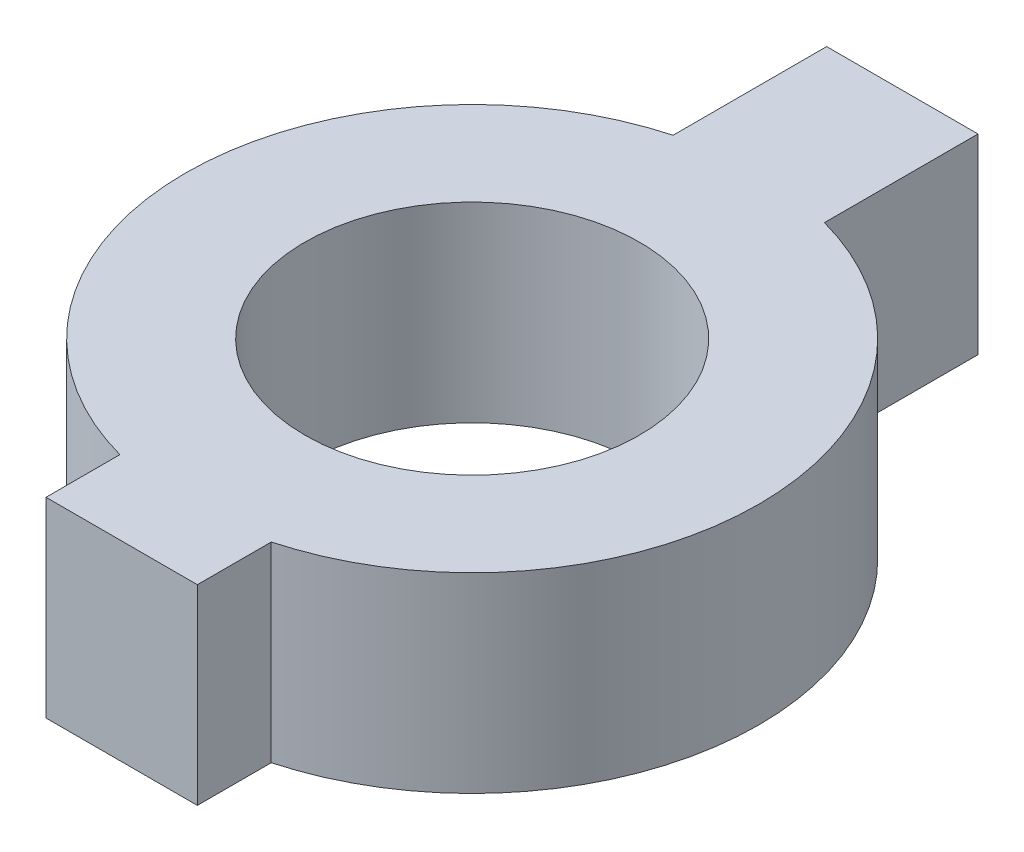
ISO-10303-21;
HEADER;
FILE_DESCRIPTION(('STEP AP214'),'2;1');
FILE_NAME('part.step','',(''),(''),'','','');
FILE_SCHEMA(('AUTOMOTIVE_DESIGN { 1 0 10303 214 1 1 1 1 }'));
ENDSEC;
DATA;
#1=APPLICATION_CONTEXT('core data for automotive mechanical design processes');
#2=APPLICATION_PROTOCOL_DEFINITION('international standard','automotive_design',2000,#1);
#3=PRODUCT_CONTEXT('',#1,'mechanical');
#4=PRODUCT('Part','Part','',(#3));
#5=PRODUCT_RELATED_PRODUCT_CATEGORY('part','',(#4));
#6=PRODUCT_DEFINITION_FORMATION('','',#4);
#7=PRODUCT_DEFINITION_CONTEXT('part definition',#1,'design');
#8=PRODUCT_DEFINITION('design','',#6,#7);
#9=PRODUCT_DEFINITION_SHAPE('','',#8);
#10=(LENGTH_UNIT() NAMED_UNIT(*) SI_UNIT(.MILLI.,.METRE.));
#11=(NAMED_UNIT(*) PLANE_ANGLE_UNIT() SI_UNIT($,.RADIAN.));
#12=(NAMED_UNIT(*) SI_UNIT($,.STERADIAN.) SOLID_ANGLE_UNIT());
#13=UNCERTAINTY_MEASURE_WITH_UNIT(LENGTH_MEASURE(1.E-05),#10,'distance_accuracy_value','');
#14=(GEOMETRIC_REPRESENTATION_CONTEXT(3) GLOBAL_UNCERTAINTY_ASSIGNED_CONTEXT((#13)) GLOBAL_UNIT_ASSIGNED_CONTEXT((#10,
#11,#12)) REPRESENTATION_CONTEXT('',''));
#15=CARTESIAN_POINT('',(0.,0.,0.));
#16=DIRECTION('',(0.,0.,1.));
#17=DIRECTION('',(1.,0.,0.));
#18=AXIS2_PLACEMENT_3D('',#15,#16,#17);
#19=CARTESIAN_POINT('',(0.,12.,0.));
#20=DIRECTION('',(0.,-1.,0.));
#21=DIRECTION('',(0.,0.,-1.));
#22=AXIS2_PLACEMENT_3D('',#19,#20,#21);
#23=CYLINDRICAL_SURFACE('',#22,18.);
#24=CARTESIAN_POINT('',(0.,0.,0.));
#25=DIRECTION('',(0.,1.,0.));
#26=DIRECTION('',(0.,0.,1.));
#27=AXIS2_PLACEMENT_3D('',#24,#25,#26);
#28=CIRCLE('',#27,18.);
#29=CARTESIAN_POINT('',(4.75,0.,17.3619555350197));
#30=VERTEX_POINT('',#29);
#31=CARTESIAN_POINT('',(4.74999999999999,0.,-17.3619555350197));
#32=VERTEX_POINT('',#31);
#33=EDGE_CURVE('E148',#30,#32,#28,.T.);
#34=ORIENTED_EDGE('',*,*,#33,.T.);
#35=DIRECTION('',(0.,-1.,0.));
#36=VECTOR('',#35,1.);
#37=CARTESIAN_POINT('',(4.74999999999999,12.,-17.3619555350197));
#38=LINE('',#37,#36);
#39=CARTESIAN_POINT('',(4.74999999999999,12.,-17.3619555350197));
#40=VERTEX_POINT('',#39);
#41=EDGE_CURVE('E11',#40,#32,#38,.T.);
#42=ORIENTED_EDGE('',*,*,#41,.F.);
#43=CARTESIAN_POINT('',(0.,12.,0.));
#44=DIRECTION('',(0.,1.,0.));
#45=DIRECTION('',(0.,0.,1.));
#46=AXIS2_PLACEMENT_3D('',#43,#44,#45);
#47=CIRCLE('',#46,18.);
#48=CARTESIAN_POINT('',(4.75,12.,17.3619555350197));
#49=VERTEX_POINT('',#48);
#50=EDGE_CURVE('E137',#49,#40,#47,.T.);
#51=ORIENTED_EDGE('',*,*,#50,.F.);
#52=DIRECTION('',(0.,-1.,0.));
#53=VECTOR('',#52,1.);
#54=CARTESIAN_POINT('',(4.75,12.,17.3619555350197));
#55=LINE('',#54,#53);
#56=EDGE_CURVE('E143',#49,#30,#55,.T.);
#57=ORIENTED_EDGE('',*,*,#56,.T.);
#58=EDGE_LOOP('',(#34,#42,#51,#57));
#59=FACE_BOUND('',#58,.T.);
#60=ADVANCED_FACE('F37',(#59),#23,.T.);
#61=CARTESIAN_POINT('',(4.74999999999999,12.,0.));
#62=DIRECTION('',(-1.,0.,0.));
#63=DIRECTION('',(0.,0.,1.));
#64=AXIS2_PLACEMENT_3D('',#61,#62,#63);
#65=PLANE('',#64);
#66=DIRECTION('',(0.,0.,-1.));
#67=VECTOR('',#66,1.);
#68=CARTESIAN_POINT('',(4.74999999999999,0.,0.));
#69=LINE('',#68,#67);
#70=CARTESIAN_POINT('',(4.74999999999998,0.,-27.));
#71=VERTEX_POINT('',#70);
#72=EDGE_CURVE('E152',#32,#71,#69,.T.);
#73=ORIENTED_EDGE('',*,*,#72,.T.);
#74=DIRECTION('',(0.,-1.,0.));
#75=VECTOR('',#74,1.);
#76=CARTESIAN_POINT('',(4.74999999999998,12.,-27.));
#77=LINE('',#76,#75);
#78=CARTESIAN_POINT('',(4.74999999999998,12.,-27.));
#79=VERTEX_POINT('',#78);
#80=EDGE_CURVE('E47',#79,#71,#77,.T.);
#81=ORIENTED_EDGE('',*,*,#80,.F.);
#82=DIRECTION('',(0.,0.,-1.));
#83=VECTOR('',#82,1.);
#84=CARTESIAN_POINT('',(4.74999999999999,12.,0.));
#85=LINE('',#84,#83);
#86=EDGE_CURVE('E97',#40,#79,#85,.T.);
#87=ORIENTED_EDGE('',*,*,#86,.F.);
#88=ORIENTED_EDGE('',*,*,#41,.T.);
#89=EDGE_LOOP('',(#73,#81,#87,#88));
#90=FACE_BOUND('',#89,.T.);
#91=ADVANCED_FACE('F190',(#90),#65,.F.);
#92=CARTESIAN_POINT('',(0.,12.,-27.));
#93=DIRECTION('',(0.,0.,-1.));
#94=DIRECTION('',(-1.,0.,0.));
#95=AXIS2_PLACEMENT_3D('',#92,#93,#94);
#96=PLANE('',#95);
#97=DIRECTION('',(1.,0.,0.));
#98=VECTOR('',#97,1.);
#99=CARTESIAN_POINT('',(0.,0.,-27.));
#100=LINE('',#99,#98);
#101=CARTESIAN_POINT('',(-4.75,0.,-27.));
#102=VERTEX_POINT('',#101);
#103=EDGE_CURVE('E157',#102,#71,#100,.T.);
#104=ORIENTED_EDGE('',*,*,#103,.F.);
#105=DIRECTION('',(0.,-1.,0.));
#106=VECTOR('',#105,1.);
#107=CARTESIAN_POINT('',(-4.75,12.,-27.));
#108=LINE('',#107,#106);
#109=CARTESIAN_POINT('',(-4.75,12.,-27.));
#110=VERTEX_POINT('',#109);
#111=EDGE_CURVE('E181',#110,#102,#108,.T.);
#112=ORIENTED_EDGE('',*,*,#111,.F.);
#113=DIRECTION('',(1.,0.,0.));
#114=VECTOR('',#113,1.);
#115=CARTESIAN_POINT('',(0.,12.,-27.));
#116=LINE('',#115,#114);
#117=EDGE_CURVE('E189',#110,#79,#116,.T.);
#118=ORIENTED_EDGE('',*,*,#117,.T.);
#119=ORIENTED_EDGE('',*,*,#80,.T.);
#120=EDGE_LOOP('',(#104,#112,#118,#119));
#121=FACE_BOUND('',#120,.T.);
#122=ADVANCED_FACE('F187',(#121),#96,.T.);
#123=CARTESIAN_POINT('',(-4.75,12.,0.));
#124=DIRECTION('',(-1.,0.,0.));
#125=DIRECTION('',(0.,0.,1.));
#126=AXIS2_PLACEMENT_3D('',#123,#124,#125);
#127=PLANE('',#126);
#128=DIRECTION('',(0.,0.,-1.));
#129=VECTOR('',#128,1.);
#130=CARTESIAN_POINT('',(-4.75,0.,0.));
#131=LINE('',#130,#129);
#132=CARTESIAN_POINT('',(-4.75,0.,-17.3619555350197));
#133=VERTEX_POINT('',#132);
#134=EDGE_CURVE('E161',#133,#102,#131,.T.);
#135=ORIENTED_EDGE('',*,*,#134,.F.);
#136=DIRECTION('',(0.,-1.,0.));
#137=VECTOR('',#136,1.);
#138=CARTESIAN_POINT('',(-4.75,12.,-17.3619555350197));
#139=LINE('',#138,#137);
#140=CARTESIAN_POINT('',(-4.75,12.,-17.3619555350197));
#141=VERTEX_POINT('',#140);
#142=EDGE_CURVE('E178',#141,#133,#139,.T.);
#143=ORIENTED_EDGE('',*,*,#142,.F.);
#144=DIRECTION('',(0.,0.,-1.));
#145=VECTOR('',#144,1.);
#146=CARTESIAN_POINT('',(-4.75,12.,0.));
#147=LINE('',#146,#145);
#148=EDGE_CURVE('E135',#141,#110,#147,.T.);
#149=ORIENTED_EDGE('',*,*,#148,.T.);
#150=ORIENTED_EDGE('',*,*,#111,.T.);
#151=EDGE_LOOP('',(#135,#143,#149,#150));
#152=FACE_BOUND('',#151,.T.);
#153=ADVANCED_FACE('F199',(#152),#127,.T.);
#154=CARTESIAN_POINT('',(-4.75,0.,17.3619555350197));
#155=VERTEX_POINT('',#154);
#156=EDGE_CURVE('E153',#133,#155,#28,.T.);
#157=ORIENTED_EDGE('',*,*,#156,.T.);
#158=DIRECTION('',(0.,-1.,0.));
#159=VECTOR('',#158,1.);
#160=CARTESIAN_POINT('',(-4.75,12.,17.3619555350197));
#161=LINE('',#160,#159);
#162=CARTESIAN_POINT('',(-4.75,12.,17.3619555350197));
#163=VERTEX_POINT('',#162);
#164=EDGE_CURVE('E120',#163,#155,#161,.T.);
#165=ORIENTED_EDGE('',*,*,#164,.F.);
#166=EDGE_CURVE('E130',#141,#163,#47,.T.);
#167=ORIENTED_EDGE('',*,*,#166,.F.);
#168=ORIENTED_EDGE('',*,*,#142,.T.);
#169=EDGE_LOOP('',(#157,#165,#167,#168));
#170=FACE_BOUND('',#169,.T.);
#171=ADVANCED_FACE('F226',(#170),#23,.T.);
#172=CARTESIAN_POINT('',(-4.75,12.,0.));
#173=DIRECTION('',(-1.,0.,0.));
#174=DIRECTION('',(0.,0.,1.));
#175=AXIS2_PLACEMENT_3D('',#172,#173,#174);
#176=PLANE('',#175);
#177=DIRECTION('',(0.,0.,-1.));
#178=VECTOR('',#177,1.);
#179=CARTESIAN_POINT('',(-4.75,0.,0.));
#180=LINE('',#179,#178);
#181=CARTESIAN_POINT('',(-4.75,0.,22.));
#182=VERTEX_POINT('',#181);
#183=EDGE_CURVE('E118',#182,#155,#180,.T.);
#184=ORIENTED_EDGE('',*,*,#183,.F.);
#185=DIRECTION('',(0.,-1.,0.));
#186=VECTOR('',#185,1.);
#187=CARTESIAN_POINT('',(-4.75,12.,22.));
#188=LINE('',#187,#186);
#189=CARTESIAN_POINT('',(-4.75,12.,22.));
#190=VERTEX_POINT('',#189);
#191=EDGE_CURVE('E112',#190,#182,#188,.T.);
#192=ORIENTED_EDGE('',*,*,#191,.F.);
#193=DIRECTION('',(0.,0.,-1.));
#194=VECTOR('',#193,1.);
#195=CARTESIAN_POINT('',(-4.75,12.,0.));
#196=LINE('',#195,#194);
#197=EDGE_CURVE('E116',#190,#163,#196,.T.);
#198=ORIENTED_EDGE('',*,*,#197,.T.);
#199=ORIENTED_EDGE('',*,*,#164,.T.);
#200=EDGE_LOOP('',(#184,#192,#198,#199));
#201=FACE_BOUND('',#200,.T.);
#202=ADVANCED_FACE('F114',(#201),#176,.T.);
#203=CARTESIAN_POINT('',(0.,12.,22.));
#204=DIRECTION('',(0.,0.,-1.));
#205=DIRECTION('',(-1.,0.,0.));
#206=AXIS2_PLACEMENT_3D('',#203,#204,#205);
#207=PLANE('',#206);
#208=DIRECTION('',(1.,0.,0.));
#209=VECTOR('',#208,1.);
#210=CARTESIAN_POINT('',(0.,0.,22.));
#211=LINE('',#210,#209);
#212=CARTESIAN_POINT('',(4.75,0.,22.));
#213=VERTEX_POINT('',#212);
#214=EDGE_CURVE('E83',#182,#213,#211,.T.);
#215=ORIENTED_EDGE('',*,*,#214,.T.);
#216=DIRECTION('',(0.,-1.,0.));
#217=VECTOR('',#216,1.);
#218=CARTESIAN_POINT('',(4.75,12.,22.));
#219=LINE('',#218,#217);
#220=CARTESIAN_POINT('',(4.75,12.,22.));
#221=VERTEX_POINT('',#220);
#222=EDGE_CURVE('E121',#221,#213,#219,.T.);
#223=ORIENTED_EDGE('',*,*,#222,.F.);
#224=DIRECTION('',(1.,0.,0.));
#225=VECTOR('',#224,1.);
#226=CARTESIAN_POINT('',(0.,12.,22.));
#227=LINE('',#226,#225);
#228=EDGE_CURVE('E123',#190,#221,#227,.T.);
#229=ORIENTED_EDGE('',*,*,#228,.F.);
#230=ORIENTED_EDGE('',*,*,#191,.T.);
#231=EDGE_LOOP('',(#215,#223,#229,#230));
#232=FACE_BOUND('',#231,.T.);
#233=ADVANCED_FACE('F124',(#232),#207,.F.);
#234=CARTESIAN_POINT('',(0.,12.,0.));
#235=DIRECTION('',(0.,-1.,0.));
#236=DIRECTION('',(0.,0.,-1.));
#237=AXIS2_PLACEMENT_3D('',#234,#235,#236);
#238=CYLINDRICAL_SURFACE('',#237,10.5);
#239=CARTESIAN_POINT('',(0.,12.,0.));
#240=DIRECTION('',(0.,1.,0.));
#241=DIRECTION('',(0.,0.,1.));
#242=AXIS2_PLACEMENT_3D('',#239,#240,#241);
#243=CIRCLE('',#242,10.5);
#244=CARTESIAN_POINT('',(0.,12.,10.5));
#245=VERTEX_POINT('',#244);
#246=EDGE_CURVE('E171',#245,#245,#243,.T.);
#247=ORIENTED_EDGE('',*,*,#246,.T.);
#248=EDGE_LOOP('',(#247));
#249=FACE_BOUND('',#248,.T.);
#250=CARTESIAN_POINT('',(0.,0.,0.));
#251=DIRECTION('',(0.,1.,0.));
#252=DIRECTION('',(0.,0.,1.));
#253=AXIS2_PLACEMENT_3D('',#250,#251,#252);
#254=CIRCLE('',#253,10.5);
#255=CARTESIAN_POINT('',(0.,0.,10.5));
#256=VERTEX_POINT('',#255);
#257=EDGE_CURVE('E144',#256,#256,#254,.T.);
#258=ORIENTED_EDGE('',*,*,#257,.F.);
#259=EDGE_LOOP('',(#258));
#260=FACE_BOUND('',#259,.T.);
#261=ADVANCED_FACE('F39',(#249,#260),#238,.F.);
#262=CARTESIAN_POINT('',(4.74999999999999,12.,0.));
#263=DIRECTION('',(-1.,0.,0.));
#264=DIRECTION('',(0.,0.,1.));
#265=AXIS2_PLACEMENT_3D('',#262,#263,#264);
#266=PLANE('',#265);
#267=DIRECTION('',(0.,0.,-1.));
#268=VECTOR('',#267,1.);
#269=CARTESIAN_POINT('',(4.74999999999999,0.,0.));
#270=LINE('',#269,#268);
#271=EDGE_CURVE('E89',#213,#30,#270,.T.);
#272=ORIENTED_EDGE('',*,*,#271,.T.);
#273=ORIENTED_EDGE('',*,*,#56,.F.);
#274=DIRECTION('',(0.,0.,-1.));
#275=VECTOR('',#274,1.);
#276=CARTESIAN_POINT('',(4.74999999999999,12.,0.));
#277=LINE('',#276,#275);
#278=EDGE_CURVE('E55',#221,#49,#277,.T.);
#279=ORIENTED_EDGE('',*,*,#278,.F.);
#280=ORIENTED_EDGE('',*,*,#222,.T.);
#281=EDGE_LOOP('',(#272,#273,#279,#280));
#282=FACE_BOUND('',#281,.T.);
#283=ADVANCED_FACE('F214',(#282),#266,.F.);
#284=CARTESIAN_POINT('',(0.,12.,0.));
#285=DIRECTION('',(0.,1.,0.));
#286=DIRECTION('',(0.,0.,1.));
#287=AXIS2_PLACEMENT_3D('',#284,#285,#286);
#288=PLANE('',#287);
#289=ORIENTED_EDGE('',*,*,#246,.F.);
#290=EDGE_LOOP('',(#289));
#291=FACE_BOUND('',#290,.T.);
#292=ORIENTED_EDGE('',*,*,#50,.T.);
#293=ORIENTED_EDGE('',*,*,#86,.T.);
#294=ORIENTED_EDGE('',*,*,#117,.F.);
#295=ORIENTED_EDGE('',*,*,#148,.F.);
#296=ORIENTED_EDGE('',*,*,#166,.T.);
#297=ORIENTED_EDGE('',*,*,#197,.F.);
#298=ORIENTED_EDGE('',*,*,#228,.T.);
#299=ORIENTED_EDGE('',*,*,#278,.T.);
#300=EDGE_LOOP('',(#292,#293,#294,#295,#296,#297,#298,#299));
#301=FACE_BOUND('',#300,.T.);
#302=ADVANCED_FACE('F127',(#291,#301),#288,.T.);
#303=CARTESIAN_POINT('',(0.,0.,0.));
#304=DIRECTION('',(0.,1.,0.));
#305=DIRECTION('',(0.,0.,1.));
#306=AXIS2_PLACEMENT_3D('',#303,#304,#305);
#307=PLANE('',#306);
#308=ORIENTED_EDGE('',*,*,#257,.T.);
#309=EDGE_LOOP('',(#308));
#310=FACE_BOUND('',#309,.T.);
#311=ORIENTED_EDGE('',*,*,#33,.F.);
#312=ORIENTED_EDGE('',*,*,#271,.F.);
#313=ORIENTED_EDGE('',*,*,#214,.F.);
#314=ORIENTED_EDGE('',*,*,#183,.T.);
#315=ORIENTED_EDGE('',*,*,#156,.F.);
#316=ORIENTED_EDGE('',*,*,#134,.T.);
#317=ORIENTED_EDGE('',*,*,#103,.T.);
#318=ORIENTED_EDGE('',*,*,#72,.F.);
#319=EDGE_LOOP('',(#311,#312,#313,#314,#315,#316,#317,#318));
#320=FACE_BOUND('',#319,.T.);
#321=ADVANCED_FACE('F194',(#310,#320),#307,.F.);
#322=CLOSED_SHELL('',(#60,#91,#122,#153,#171,#202,#233,#261,#283,#302,#321));
#323=MANIFOLD_SOLID_BREP('B2',#322);
#324=ADVANCED_BREP_SHAPE_REPRESENTATION('',(#18,#323),#14);
#325=SHAPE_DEFINITION_REPRESENTATION(#9,#324);
ENDSEC;
END-ISO-10303-21;
